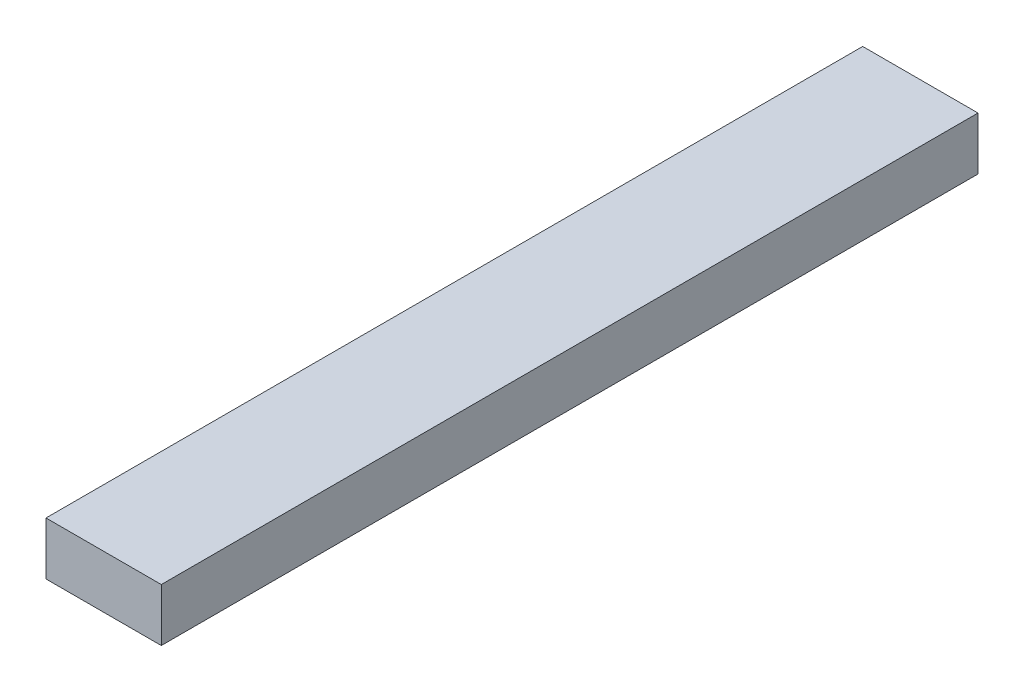
ISO-10303-21;
HEADER;
FILE_DESCRIPTION(('STEP AP214'),'2;1');
FILE_NAME('part.step','',(''),(''),'','','');
FILE_SCHEMA(('AUTOMOTIVE_DESIGN { 1 0 10303 214 1 1 1 1 }'));
ENDSEC;
DATA;
#1=APPLICATION_CONTEXT('core data for automotive mechanical design processes');
#2=APPLICATION_PROTOCOL_DEFINITION('international standard','automotive_design',2000,#1);
#3=PRODUCT_CONTEXT('',#1,'mechanical');
#4=PRODUCT('Part','Part','',(#3));
#5=PRODUCT_RELATED_PRODUCT_CATEGORY('part','',(#4));
#6=PRODUCT_DEFINITION_FORMATION('','',#4);
#7=PRODUCT_DEFINITION_CONTEXT('part definition',#1,'design');
#8=PRODUCT_DEFINITION('design','',#6,#7);
#9=PRODUCT_DEFINITION_SHAPE('','',#8);
#10=(LENGTH_UNIT() NAMED_UNIT(*) SI_UNIT(.MILLI.,.METRE.));
#11=(NAMED_UNIT(*) PLANE_ANGLE_UNIT() SI_UNIT($,.RADIAN.));
#12=(NAMED_UNIT(*) SI_UNIT($,.STERADIAN.) SOLID_ANGLE_UNIT());
#13=UNCERTAINTY_MEASURE_WITH_UNIT(LENGTH_MEASURE(1.E-05),#10,'distance_accuracy_value','');
#14=(GEOMETRIC_REPRESENTATION_CONTEXT(3) GLOBAL_UNCERTAINTY_ASSIGNED_CONTEXT((#13)) GLOBAL_UNIT_ASSIGNED_CONTEXT((#10,
#11,#12)) REPRESENTATION_CONTEXT('',''));
#15=CARTESIAN_POINT('',(0.,0.,0.));
#16=DIRECTION('',(0.,0.,1.));
#17=DIRECTION('',(1.,0.,0.));
#18=AXIS2_PLACEMENT_3D('',#15,#16,#17);
#19=CARTESIAN_POINT('',(24.,11.,0.));
#20=DIRECTION('',(0.,1.,0.));
#21=DIRECTION('',(0.,0.,1.));
#22=AXIS2_PLACEMENT_3D('',#19,#20,#21);
#23=PLANE('',#22);
#24=DIRECTION('',(1.,0.,0.));
#25=VECTOR('',#24,1.);
#26=CARTESIAN_POINT('',(0.,11.,340.));
#27=LINE('',#26,#25);
#28=CARTESIAN_POINT('',(24.,11.,340.));
#29=VERTEX_POINT('',#28);
#30=CARTESIAN_POINT('',(-24.,11.,340.));
#31=VERTEX_POINT('',#30);
#32=EDGE_CURVE('E55',#29,#31,#27,.F.);
#33=ORIENTED_EDGE('',*,*,#32,.F.);
#34=DIRECTION('',(0.,0.,-1.));
#35=VECTOR('',#34,1.);
#36=CARTESIAN_POINT('',(24.,11.,0.));
#37=LINE('',#36,#35);
#38=CARTESIAN_POINT('',(24.,11.,0.));
#39=VERTEX_POINT('',#38);
#40=EDGE_CURVE('E67',#39,#29,#37,.F.);
#41=ORIENTED_EDGE('',*,*,#40,.F.);
#42=DIRECTION('',(1.,0.,0.));
#43=VECTOR('',#42,1.);
#44=CARTESIAN_POINT('',(0.,11.,0.));
#45=LINE('',#44,#43);
#46=CARTESIAN_POINT('',(-24.,11.,0.));
#47=VERTEX_POINT('',#46);
#48=EDGE_CURVE('E20',#39,#47,#45,.F.);
#49=ORIENTED_EDGE('',*,*,#48,.T.);
#50=DIRECTION('',(0.,0.,1.));
#51=VECTOR('',#50,1.);
#52=CARTESIAN_POINT('',(-24.,11.,0.));
#53=LINE('',#52,#51);
#54=EDGE_CURVE('E81',#31,#47,#53,.F.);
#55=ORIENTED_EDGE('',*,*,#54,.F.);
#56=EDGE_LOOP('',(#33,#41,#49,#55));
#57=FACE_BOUND('',#56,.T.);
#58=ADVANCED_FACE('F17',(#57),#23,.T.);
#59=CARTESIAN_POINT('',(0.,0.,0.));
#60=DIRECTION('',(0.,0.,1.));
#61=DIRECTION('',(1.,0.,0.));
#62=AXIS2_PLACEMENT_3D('',#59,#60,#61);
#63=PLANE('',#62);
#64=DIRECTION('',(0.,1.,0.));
#65=VECTOR('',#64,1.);
#66=CARTESIAN_POINT('',(24.,-11.,0.));
#67=LINE('',#66,#65);
#68=CARTESIAN_POINT('',(24.,-11.,0.));
#69=VERTEX_POINT('',#68);
#70=EDGE_CURVE('E62',#69,#39,#67,.T.);
#71=ORIENTED_EDGE('',*,*,#70,.F.);
#72=DIRECTION('',(1.,0.,0.));
#73=VECTOR('',#72,1.);
#74=CARTESIAN_POINT('',(-24.,-11.,0.));
#75=LINE('',#74,#73);
#76=CARTESIAN_POINT('',(-24.,-11.,0.));
#77=VERTEX_POINT('',#76);
#78=EDGE_CURVE('E83',#77,#69,#75,.T.);
#79=ORIENTED_EDGE('',*,*,#78,.F.);
#80=DIRECTION('',(0.,1.,0.));
#81=VECTOR('',#80,1.);
#82=CARTESIAN_POINT('',(-24.,11.,0.));
#83=LINE('',#82,#81);
#84=EDGE_CURVE('E65',#47,#77,#83,.F.);
#85=ORIENTED_EDGE('',*,*,#84,.F.);
#86=ORIENTED_EDGE('',*,*,#48,.F.);
#87=EDGE_LOOP('',(#71,#79,#85,#86));
#88=FACE_BOUND('',#87,.T.);
#89=ADVANCED_FACE('F60',(#88),#63,.F.);
#90=CARTESIAN_POINT('',(24.,-11.,0.));
#91=DIRECTION('',(1.,0.,0.));
#92=DIRECTION('',(0.,0.,-1.));
#93=AXIS2_PLACEMENT_3D('',#90,#91,#92);
#94=PLANE('',#93);
#95=DIRECTION('',(0.,1.,0.));
#96=VECTOR('',#95,1.);
#97=CARTESIAN_POINT('',(24.,0.,340.));
#98=LINE('',#97,#96);
#99=CARTESIAN_POINT('',(24.,-11.,340.));
#100=VERTEX_POINT('',#99);
#101=EDGE_CURVE('E77',#100,#29,#98,.T.);
#102=ORIENTED_EDGE('',*,*,#101,.F.);
#103=DIRECTION('',(0.,0.,1.));
#104=VECTOR('',#103,1.);
#105=CARTESIAN_POINT('',(24.,-11.,0.));
#106=LINE('',#105,#104);
#107=EDGE_CURVE('E73',#69,#100,#106,.T.);
#108=ORIENTED_EDGE('',*,*,#107,.F.);
#109=ORIENTED_EDGE('',*,*,#70,.T.);
#110=ORIENTED_EDGE('',*,*,#40,.T.);
#111=EDGE_LOOP('',(#102,#108,#109,#110));
#112=FACE_BOUND('',#111,.T.);
#113=ADVANCED_FACE('F71',(#112),#94,.T.);
#114=CARTESIAN_POINT('',(0.,0.,340.));
#115=DIRECTION('',(0.,0.,1.));
#116=DIRECTION('',(1.,0.,0.));
#117=AXIS2_PLACEMENT_3D('',#114,#115,#116);
#118=PLANE('',#117);
#119=DIRECTION('',(1.,0.,0.));
#120=VECTOR('',#119,1.);
#121=CARTESIAN_POINT('',(-24.,-11.,340.));
#122=LINE('',#121,#120);
#123=CARTESIAN_POINT('',(-24.,-11.,340.));
#124=VERTEX_POINT('',#123);
#125=EDGE_CURVE('E26',#100,#124,#122,.F.);
#126=ORIENTED_EDGE('',*,*,#125,.F.);
#127=ORIENTED_EDGE('',*,*,#101,.T.);
#128=ORIENTED_EDGE('',*,*,#32,.T.);
#129=DIRECTION('',(0.,1.,0.));
#130=VECTOR('',#129,1.);
#131=CARTESIAN_POINT('',(-24.,11.,340.));
#132=LINE('',#131,#130);
#133=EDGE_CURVE('E35',#124,#31,#132,.T.);
#134=ORIENTED_EDGE('',*,*,#133,.F.);
#135=EDGE_LOOP('',(#126,#127,#128,#134));
#136=FACE_BOUND('',#135,.T.);
#137=ADVANCED_FACE('F89',(#136),#118,.T.);
#138=CARTESIAN_POINT('',(-24.,11.,0.));
#139=DIRECTION('',(-1.,0.,0.));
#140=DIRECTION('',(0.,0.,1.));
#141=AXIS2_PLACEMENT_3D('',#138,#139,#140);
#142=PLANE('',#141);
#143=ORIENTED_EDGE('',*,*,#133,.T.);
#144=ORIENTED_EDGE('',*,*,#54,.T.);
#145=ORIENTED_EDGE('',*,*,#84,.T.);
#146=DIRECTION('',(0.,0.,1.));
#147=VECTOR('',#146,1.);
#148=CARTESIAN_POINT('',(-24.,-11.,0.));
#149=LINE('',#148,#147);
#150=EDGE_CURVE('E11',#124,#77,#149,.F.);
#151=ORIENTED_EDGE('',*,*,#150,.F.);
#152=EDGE_LOOP('',(#143,#144,#145,#151));
#153=FACE_BOUND('',#152,.T.);
#154=ADVANCED_FACE('F91',(#153),#142,.T.);
#155=CARTESIAN_POINT('',(-24.,-11.,0.));
#156=DIRECTION('',(0.,-1.,0.));
#157=DIRECTION('',(1.,0.,0.));
#158=AXIS2_PLACEMENT_3D('',#155,#156,#157);
#159=PLANE('',#158);
#160=ORIENTED_EDGE('',*,*,#125,.T.);
#161=ORIENTED_EDGE('',*,*,#150,.T.);
#162=ORIENTED_EDGE('',*,*,#78,.T.);
#163=ORIENTED_EDGE('',*,*,#107,.T.);
#164=EDGE_LOOP('',(#160,#161,#162,#163));
#165=FACE_BOUND('',#164,.T.);
#166=ADVANCED_FACE('F88',(#165),#159,.T.);
#167=CLOSED_SHELL('',(#58,#89,#113,#137,#154,#166));
#168=MANIFOLD_SOLID_BREP('B1',#167);
#169=ADVANCED_BREP_SHAPE_REPRESENTATION('',(#18,#168),#14);
#170=SHAPE_DEFINITION_REPRESENTATION(#9,#169);
ENDSEC;
END-ISO-10303-21;
